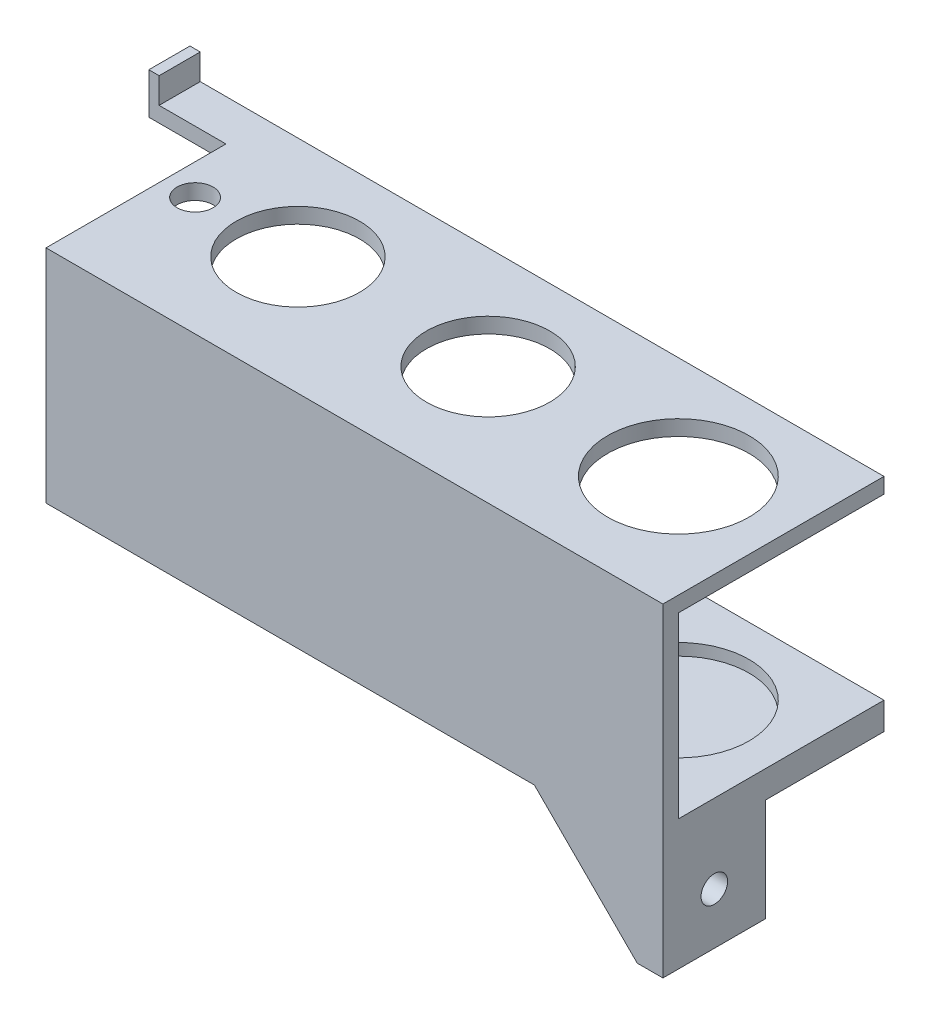
ISO-10303-21;
HEADER;
FILE_DESCRIPTION(('STEP AP214'),'2;1');
FILE_NAME('part.step','',(''),(''),'','','');
FILE_SCHEMA(('AUTOMOTIVE_DESIGN { 1 0 10303 214 1 1 1 1 }'));
ENDSEC;
DATA;
#1=APPLICATION_CONTEXT('core data for automotive mechanical design processes');
#2=APPLICATION_PROTOCOL_DEFINITION('international standard','automotive_design',2000,#1);
#3=PRODUCT_CONTEXT('',#1,'mechanical');
#4=PRODUCT('Part','Part','',(#3));
#5=PRODUCT_RELATED_PRODUCT_CATEGORY('part','',(#4));
#6=PRODUCT_DEFINITION_FORMATION('','',#4);
#7=PRODUCT_DEFINITION_CONTEXT('part definition',#1,'design');
#8=PRODUCT_DEFINITION('design','',#6,#7);
#9=PRODUCT_DEFINITION_SHAPE('','',#8);
#10=(LENGTH_UNIT() NAMED_UNIT(*) SI_UNIT(.MILLI.,.METRE.));
#11=(NAMED_UNIT(*) PLANE_ANGLE_UNIT() SI_UNIT($,.RADIAN.));
#12=(NAMED_UNIT(*) SI_UNIT($,.STERADIAN.) SOLID_ANGLE_UNIT());
#13=UNCERTAINTY_MEASURE_WITH_UNIT(LENGTH_MEASURE(1.E-05),#10,'distance_accuracy_value','');
#14=(GEOMETRIC_REPRESENTATION_CONTEXT(3) GLOBAL_UNCERTAINTY_ASSIGNED_CONTEXT((#13)) GLOBAL_UNIT_ASSIGNED_CONTEXT((#10,
#11,#12)) REPRESENTATION_CONTEXT('',''));
#15=CARTESIAN_POINT('',(0.,0.,0.));
#16=DIRECTION('',(0.,0.,1.));
#17=DIRECTION('',(1.,0.,0.));
#18=AXIS2_PLACEMENT_3D('',#15,#16,#17);
#19=CARTESIAN_POINT('',(0.,10.,0.));
#20=DIRECTION('',(0.,-1.,0.));
#21=DIRECTION('',(0.,0.,-1.));
#22=AXIS2_PLACEMENT_3D('',#19,#20,#21);
#23=PLANE('',#22);
#24=CARTESIAN_POINT('',(100.,10.,-23.));
#25=DIRECTION('',(0.,1.,0.));
#26=DIRECTION('',(0.,0.,1.));
#27=AXIS2_PLACEMENT_3D('',#24,#25,#26);
#28=CIRCLE('',#27,13.75);
#29=CARTESIAN_POINT('',(100.,10.,-9.25));
#30=VERTEX_POINT('',#29);
#31=EDGE_CURVE('E271',#30,#30,#28,.T.);
#32=ORIENTED_EDGE('',*,*,#31,.F.);
#33=EDGE_LOOP('',(#32));
#34=FACE_BOUND('',#33,.T.);
#35=CARTESIAN_POINT('',(63.,10.,-23.));
#36=DIRECTION('',(0.,1.,0.));
#37=DIRECTION('',(0.,0.,1.));
#38=AXIS2_PLACEMENT_3D('',#35,#36,#37);
#39=CIRCLE('',#38,12.);
#40=CARTESIAN_POINT('',(63.,10.,-11.));
#41=VERTEX_POINT('',#40);
#42=EDGE_CURVE('E279',#41,#41,#39,.T.);
#43=ORIENTED_EDGE('',*,*,#42,.F.);
#44=EDGE_LOOP('',(#43));
#45=FACE_BOUND('',#44,.T.);
#46=CARTESIAN_POINT('',(26.,10.,-23.));
#47=DIRECTION('',(0.,1.,0.));
#48=DIRECTION('',(0.,0.,1.));
#49=AXIS2_PLACEMENT_3D('',#46,#47,#48);
#50=CIRCLE('',#49,12.);
#51=CARTESIAN_POINT('',(26.,10.,-11.));
#52=VERTEX_POINT('',#51);
#53=EDGE_CURVE('E287',#52,#52,#50,.T.);
#54=ORIENTED_EDGE('',*,*,#53,.F.);
#55=EDGE_LOOP('',(#54));
#56=FACE_BOUND('',#55,.T.);
#57=CARTESIAN_POINT('',(6.,10.,-23.));
#58=DIRECTION('',(0.,1.,0.));
#59=DIRECTION('',(0.,0.,1.));
#60=AXIS2_PLACEMENT_3D('',#57,#58,#59);
#61=CIRCLE('',#60,3.5);
#62=CARTESIAN_POINT('',(6.,10.,-19.5));
#63=VERTEX_POINT('',#62);
#64=EDGE_CURVE('E295',#63,#63,#61,.T.);
#65=ORIENTED_EDGE('',*,*,#64,.F.);
#66=EDGE_LOOP('',(#65));
#67=FACE_BOUND('',#66,.T.);
#68=DIRECTION('',(0.,0.,-1.));
#69=VECTOR('',#68,1.);
#70=CARTESIAN_POINT('',(-13.,10.,-43.));
#71=LINE('',#70,#69);
#72=CARTESIAN_POINT('',(-13.,10.,-35.));
#73=VERTEX_POINT('',#72);
#74=CARTESIAN_POINT('',(-13.,10.,-43.));
#75=VERTEX_POINT('',#74);
#76=EDGE_CURVE('E57',#73,#75,#71,.T.);
#77=ORIENTED_EDGE('',*,*,#76,.F.);
#78=DIRECTION('',(1.,0.,0.));
#79=VECTOR('',#78,1.);
#80=CARTESIAN_POINT('',(0.,10.,-35.));
#81=LINE('',#80,#79);
#82=CARTESIAN_POINT('',(0.,10.,-35.));
#83=VERTEX_POINT('',#82);
#84=EDGE_CURVE('E201',#73,#83,#81,.T.);
#85=ORIENTED_EDGE('',*,*,#84,.T.);
#86=DIRECTION('',(0.,0.,1.));
#87=VECTOR('',#86,1.);
#88=CARTESIAN_POINT('',(0.,10.,0.));
#89=LINE('',#88,#87);
#90=CARTESIAN_POINT('',(0.,10.,0.));
#91=VERTEX_POINT('',#90);
#92=EDGE_CURVE('E303',#83,#91,#89,.T.);
#93=ORIENTED_EDGE('',*,*,#92,.T.);
#94=DIRECTION('',(1.,0.,0.));
#95=VECTOR('',#94,1.);
#96=CARTESIAN_POINT('',(0.,10.,0.));
#97=LINE('',#96,#95);
#98=CARTESIAN_POINT('',(120.,10.,0.));
#99=VERTEX_POINT('',#98);
#100=EDGE_CURVE('E306',#91,#99,#97,.T.);
#101=ORIENTED_EDGE('',*,*,#100,.T.);
#102=DIRECTION('',(0.,0.,-1.));
#103=VECTOR('',#102,1.);
#104=CARTESIAN_POINT('',(120.,10.,0.));
#105=LINE('',#104,#103);
#106=CARTESIAN_POINT('',(120.,10.,-43.));
#107=VERTEX_POINT('',#106);
#108=EDGE_CURVE('E311',#99,#107,#105,.T.);
#109=ORIENTED_EDGE('',*,*,#108,.T.);
#110=DIRECTION('',(-1.,0.,0.));
#111=VECTOR('',#110,1.);
#112=CARTESIAN_POINT('',(0.,10.,-43.));
#113=LINE('',#112,#111);
#114=EDGE_CURVE('E314',#107,#75,#113,.T.);
#115=ORIENTED_EDGE('',*,*,#114,.T.);
#116=EDGE_LOOP('',(#77,#85,#93,#101,#109,#115));
#117=FACE_BOUND('',#116,.T.);
#118=ADVANCED_FACE('F41',(#34,#45,#56,#67,#117),#23,.F.);
#119=CARTESIAN_POINT('',(0.,0.,0.));
#120=DIRECTION('',(1.,0.,0.));
#121=DIRECTION('',(0.,0.,-1.));
#122=AXIS2_PLACEMENT_3D('',#119,#120,#121);
#123=PLANE('',#122);
#124=DIRECTION('',(0.,1.,0.));
#125=VECTOR('',#124,1.);
#126=CARTESIAN_POINT('',(0.,-10.,-35.));
#127=LINE('',#126,#125);
#128=CARTESIAN_POINT('',(0.,7.,-35.));
#129=VERTEX_POINT('',#128);
#130=EDGE_CURVE('E65',#129,#83,#127,.T.);
#131=ORIENTED_EDGE('',*,*,#130,.F.);
#132=DIRECTION('',(0.,0.,1.));
#133=VECTOR('',#132,1.);
#134=CARTESIAN_POINT('',(0.,7.,0.));
#135=LINE('',#134,#133);
#136=CARTESIAN_POINT('',(0.,7.,-3.));
#137=VERTEX_POINT('',#136);
#138=EDGE_CURVE('E299',#129,#137,#135,.T.);
#139=ORIENTED_EDGE('',*,*,#138,.T.);
#140=DIRECTION('',(0.,-1.,0.));
#141=VECTOR('',#140,1.);
#142=CARTESIAN_POINT('',(0.,0.,-3.));
#143=LINE('',#142,#141);
#144=CARTESIAN_POINT('',(0.,-27.7,-3.));
#145=VERTEX_POINT('',#144);
#146=EDGE_CURVE('E406',#137,#145,#143,.T.);
#147=ORIENTED_EDGE('',*,*,#146,.T.);
#148=DIRECTION('',(0.,0.,1.));
#149=VECTOR('',#148,1.);
#150=CARTESIAN_POINT('',(0.,-27.7,-43.));
#151=LINE('',#150,#149);
#152=CARTESIAN_POINT('',(0.,-27.7,-43.));
#153=VERTEX_POINT('',#152);
#154=EDGE_CURVE('E384',#153,#145,#151,.T.);
#155=ORIENTED_EDGE('',*,*,#154,.F.);
#156=DIRECTION('',(0.,1.,0.));
#157=VECTOR('',#156,1.);
#158=CARTESIAN_POINT('',(0.,-33.,-43.));
#159=LINE('',#158,#157);
#160=CARTESIAN_POINT('',(0.,-33.,-43.));
#161=VERTEX_POINT('',#160);
#162=EDGE_CURVE('E398',#161,#153,#159,.T.);
#163=ORIENTED_EDGE('',*,*,#162,.F.);
#164=DIRECTION('',(0.,0.,-1.));
#165=VECTOR('',#164,1.);
#166=CARTESIAN_POINT('',(0.,-33.,0.));
#167=LINE('',#166,#165);
#168=CARTESIAN_POINT('',(0.,-33.,0.));
#169=VERTEX_POINT('',#168);
#170=EDGE_CURVE('E416',#169,#161,#167,.T.);
#171=ORIENTED_EDGE('',*,*,#170,.F.);
#172=DIRECTION('',(0.,-1.,0.));
#173=VECTOR('',#172,1.);
#174=CARTESIAN_POINT('',(0.,0.,0.));
#175=LINE('',#174,#173);
#176=EDGE_CURVE('E401',#91,#169,#175,.T.);
#177=ORIENTED_EDGE('',*,*,#176,.F.);
#178=ORIENTED_EDGE('',*,*,#92,.F.);
#179=EDGE_LOOP('',(#131,#139,#147,#155,#163,#171,#177,#178));
#180=FACE_BOUND('',#179,.T.);
#181=ADVANCED_FACE('F443',(#180),#123,.F.);
#182=CARTESIAN_POINT('',(115.,0.,0.));
#183=DIRECTION('',(1.,0.,0.));
#184=DIRECTION('',(0.,0.,-1.));
#185=AXIS2_PLACEMENT_3D('',#182,#183,#184);
#186=PLANE('',#185);
#187=CARTESIAN_POINT('',(115.,-43.,-10.));
#188=DIRECTION('',(1.,0.,0.));
#189=DIRECTION('',(0.,0.,-1.));
#190=AXIS2_PLACEMENT_3D('',#187,#188,#189);
#191=CIRCLE('',#190,2.58371812719711);
#192=CARTESIAN_POINT('',(115.,-43.,-12.5837181271971));
#193=VERTEX_POINT('',#192);
#194=EDGE_CURVE('E233',#193,#193,#191,.T.);
#195=ORIENTED_EDGE('',*,*,#194,.T.);
#196=EDGE_LOOP('',(#195));
#197=FACE_BOUND('',#196,.T.);
#198=DIRECTION('',(0.,1.,0.));
#199=VECTOR('',#198,1.);
#200=CARTESIAN_POINT('',(115.,-53.,-2.));
#201=LINE('',#200,#199);
#202=CARTESIAN_POINT('',(115.,-53.,-2.));
#203=VERTEX_POINT('',#202);
#204=CARTESIAN_POINT('',(115.,-33.,-2.));
#205=VERTEX_POINT('',#204);
#206=EDGE_CURVE('E218',#203,#205,#201,.T.);
#207=ORIENTED_EDGE('',*,*,#206,.T.);
#208=DIRECTION('',(0.,0.,1.));
#209=VECTOR('',#208,1.);
#210=CARTESIAN_POINT('',(115.,-33.,0.));
#211=LINE('',#210,#209);
#212=CARTESIAN_POINT('',(115.,-33.,-20.));
#213=VERTEX_POINT('',#212);
#214=EDGE_CURVE('E249',#213,#205,#211,.T.);
#215=ORIENTED_EDGE('',*,*,#214,.F.);
#216=DIRECTION('',(0.,1.,0.));
#217=VECTOR('',#216,1.);
#218=CARTESIAN_POINT('',(115.,-33.,-20.));
#219=LINE('',#218,#217);
#220=CARTESIAN_POINT('',(115.,-53.,-20.));
#221=VERTEX_POINT('',#220);
#222=EDGE_CURVE('E245',#221,#213,#219,.T.);
#223=ORIENTED_EDGE('',*,*,#222,.F.);
#224=DIRECTION('',(0.,0.,-1.));
#225=VECTOR('',#224,1.);
#226=CARTESIAN_POINT('',(115.,-53.,0.));
#227=LINE('',#226,#225);
#228=EDGE_CURVE('E246',#203,#221,#227,.T.);
#229=ORIENTED_EDGE('',*,*,#228,.F.);
#230=EDGE_LOOP('',(#207,#215,#223,#229));
#231=FACE_BOUND('',#230,.T.);
#232=ADVANCED_FACE('F480',(#197,#231),#186,.F.);
#233=CARTESIAN_POINT('',(120.,-33.,0.));
#234=DIRECTION('',(0.,1.,0.));
#235=DIRECTION('',(0.,0.,1.));
#236=AXIS2_PLACEMENT_3D('',#233,#234,#235);
#237=PLANE('',#236);
#238=CARTESIAN_POINT('',(6.,-33.,-23.));
#239=DIRECTION('',(0.,1.,0.));
#240=DIRECTION('',(0.,0.,1.));
#241=AXIS2_PLACEMENT_3D('',#238,#239,#240);
#242=CIRCLE('',#241,2.26);
#243=CARTESIAN_POINT('',(6.,-33.,-20.74));
#244=VERTEX_POINT('',#243);
#245=EDGE_CURVE('E328',#244,#244,#242,.T.);
#246=ORIENTED_EDGE('',*,*,#245,.T.);
#247=EDGE_LOOP('',(#246));
#248=FACE_BOUND('',#247,.T.);
#249=CARTESIAN_POINT('',(26.,-33.,-23.));
#250=DIRECTION('',(0.,1.,0.));
#251=DIRECTION('',(0.,0.,1.));
#252=AXIS2_PLACEMENT_3D('',#249,#250,#251);
#253=CIRCLE('',#252,2.25);
#254=CARTESIAN_POINT('',(26.,-33.,-20.75));
#255=VERTEX_POINT('',#254);
#256=EDGE_CURVE('E338',#255,#255,#253,.T.);
#257=ORIENTED_EDGE('',*,*,#256,.T.);
#258=EDGE_LOOP('',(#257));
#259=FACE_BOUND('',#258,.T.);
#260=CARTESIAN_POINT('',(63.,-33.,-23.));
#261=DIRECTION('',(0.,1.,0.));
#262=DIRECTION('',(0.,0.,1.));
#263=AXIS2_PLACEMENT_3D('',#260,#261,#262);
#264=CIRCLE('',#263,7.);
#265=CARTESIAN_POINT('',(63.,-33.,-16.));
#266=VERTEX_POINT('',#265);
#267=EDGE_CURVE('E329',#266,#266,#264,.T.);
#268=ORIENTED_EDGE('',*,*,#267,.T.);
#269=EDGE_LOOP('',(#268));
#270=FACE_BOUND('',#269,.T.);
#271=DIRECTION('',(-1.,0.,0.));
#272=VECTOR('',#271,1.);
#273=CARTESIAN_POINT('',(115.,-33.,-2.));
#274=LINE('',#273,#272);
#275=CARTESIAN_POINT('',(95.,-33.,-2.));
#276=VERTEX_POINT('',#275);
#277=EDGE_CURVE('E222',#205,#276,#274,.T.);
#278=ORIENTED_EDGE('',*,*,#277,.T.);
#279=DIRECTION('',(0.,0.,1.));
#280=VECTOR('',#279,1.);
#281=CARTESIAN_POINT('',(95.,-33.,-2.));
#282=LINE('',#281,#280);
#283=CARTESIAN_POINT('',(95.,-33.,0.));
#284=VERTEX_POINT('',#283);
#285=EDGE_CURVE('E226',#276,#284,#282,.T.);
#286=ORIENTED_EDGE('',*,*,#285,.T.);
#287=DIRECTION('',(-1.,0.,0.));
#288=VECTOR('',#287,1.);
#289=CARTESIAN_POINT('',(120.,-33.,0.));
#290=LINE('',#289,#288);
#291=EDGE_CURVE('E11',#284,#169,#290,.T.);
#292=ORIENTED_EDGE('',*,*,#291,.T.);
#293=ORIENTED_EDGE('',*,*,#170,.T.);
#294=DIRECTION('',(-1.,0.,0.));
#295=VECTOR('',#294,1.);
#296=CARTESIAN_POINT('',(120.,-33.,-43.));
#297=LINE('',#296,#295);
#298=CARTESIAN_POINT('',(120.,-33.,-43.));
#299=VERTEX_POINT('',#298);
#300=EDGE_CURVE('E394',#299,#161,#297,.T.);
#301=ORIENTED_EDGE('',*,*,#300,.F.);
#302=DIRECTION('',(0.,0.,-1.));
#303=VECTOR('',#302,1.);
#304=CARTESIAN_POINT('',(120.,-33.,0.));
#305=LINE('',#304,#303);
#306=CARTESIAN_POINT('',(120.,-33.,-20.));
#307=VERTEX_POINT('',#306);
#308=EDGE_CURVE('E405',#307,#299,#305,.T.);
#309=ORIENTED_EDGE('',*,*,#308,.F.);
#310=DIRECTION('',(1.,0.,0.));
#311=VECTOR('',#310,1.);
#312=CARTESIAN_POINT('',(115.,-33.,-20.));
#313=LINE('',#312,#311);
#314=EDGE_CURVE('E261',#213,#307,#313,.T.);
#315=ORIENTED_EDGE('',*,*,#314,.F.);
#316=ORIENTED_EDGE('',*,*,#214,.T.);
#317=EDGE_LOOP('',(#278,#286,#292,#293,#301,#309,#315,#316));
#318=FACE_BOUND('',#317,.T.);
#319=ADVANCED_FACE('F452',(#248,#259,#270,#318),#237,.F.);
#320=CARTESIAN_POINT('',(120.,0.,-3.));
#321=DIRECTION('',(0.,0.,-1.));
#322=DIRECTION('',(0.,1.,0.));
#323=AXIS2_PLACEMENT_3D('',#320,#321,#322);
#324=PLANE('',#323);
#325=DIRECTION('',(0.,-1.,0.));
#326=VECTOR('',#325,1.);
#327=CARTESIAN_POINT('',(120.,0.,-3.));
#328=LINE('',#327,#326);
#329=CARTESIAN_POINT('',(120.,7.,-3.));
#330=VERTEX_POINT('',#329);
#331=CARTESIAN_POINT('',(120.,-27.7,-3.));
#332=VERTEX_POINT('',#331);
#333=EDGE_CURVE('E409',#330,#332,#328,.T.);
#334=ORIENTED_EDGE('',*,*,#333,.T.);
#335=DIRECTION('',(1.,0.,0.));
#336=VECTOR('',#335,1.);
#337=CARTESIAN_POINT('',(120.,-27.7,-3.));
#338=LINE('',#337,#336);
#339=EDGE_CURVE('E387',#145,#332,#338,.T.);
#340=ORIENTED_EDGE('',*,*,#339,.F.);
#341=ORIENTED_EDGE('',*,*,#146,.F.);
#342=DIRECTION('',(-1.,0.,0.));
#343=VECTOR('',#342,1.);
#344=CARTESIAN_POINT('',(120.,7.,-3.));
#345=LINE('',#344,#343);
#346=EDGE_CURVE('E50',#330,#137,#345,.T.);
#347=ORIENTED_EDGE('',*,*,#346,.F.);
#348=EDGE_LOOP('',(#334,#340,#341,#347));
#349=FACE_BOUND('',#348,.T.);
#350=ADVANCED_FACE('F431',(#349),#324,.T.);
#351=CARTESIAN_POINT('',(120.,0.,0.));
#352=DIRECTION('',(0.,0.,-1.));
#353=DIRECTION('',(0.,1.,0.));
#354=AXIS2_PLACEMENT_3D('',#351,#352,#353);
#355=PLANE('',#354);
#356=ORIENTED_EDGE('',*,*,#291,.F.);
#357=DIRECTION('',(0.707106781186548,-0.707106781186548,0.));
#358=VECTOR('',#357,1.);
#359=CARTESIAN_POINT('',(95.,-33.,0.));
#360=LINE('',#359,#358);
#361=CARTESIAN_POINT('',(115.,-53.,0.));
#362=VERTEX_POINT('',#361);
#363=EDGE_CURVE('E210',#284,#362,#360,.T.);
#364=ORIENTED_EDGE('',*,*,#363,.T.);
#365=DIRECTION('',(1.,0.,0.));
#366=VECTOR('',#365,1.);
#367=CARTESIAN_POINT('',(115.,-53.,0.));
#368=LINE('',#367,#366);
#369=CARTESIAN_POINT('',(120.,-53.,0.));
#370=VERTEX_POINT('',#369);
#371=EDGE_CURVE('E253',#362,#370,#368,.T.);
#372=ORIENTED_EDGE('',*,*,#371,.T.);
#373=DIRECTION('',(0.,-1.,0.));
#374=VECTOR('',#373,1.);
#375=CARTESIAN_POINT('',(120.,0.,0.));
#376=LINE('',#375,#374);
#377=EDGE_CURVE('E402',#99,#370,#376,.T.);
#378=ORIENTED_EDGE('',*,*,#377,.F.);
#379=ORIENTED_EDGE('',*,*,#100,.F.);
#380=ORIENTED_EDGE('',*,*,#176,.T.);
#381=EDGE_LOOP('',(#356,#364,#372,#378,#379,#380));
#382=FACE_BOUND('',#381,.T.);
#383=ADVANCED_FACE('F43',(#382),#355,.F.);
#384=CARTESIAN_POINT('',(120.,0.,0.));
#385=DIRECTION('',(1.,0.,0.));
#386=DIRECTION('',(0.,0.,-1.));
#387=AXIS2_PLACEMENT_3D('',#384,#385,#386);
#388=PLANE('',#387);
#389=ORIENTED_EDGE('',*,*,#333,.F.);
#390=DIRECTION('',(0.,0.,-1.));
#391=VECTOR('',#390,1.);
#392=CARTESIAN_POINT('',(120.,7.,0.));
#393=LINE('',#392,#391);
#394=CARTESIAN_POINT('',(120.,7.,-43.));
#395=VERTEX_POINT('',#394);
#396=EDGE_CURVE('E320',#330,#395,#393,.T.);
#397=ORIENTED_EDGE('',*,*,#396,.T.);
#398=DIRECTION('',(0.,-1.,0.));
#399=VECTOR('',#398,1.);
#400=CARTESIAN_POINT('',(120.,10.,-43.));
#401=LINE('',#400,#399);
#402=EDGE_CURVE('E317',#107,#395,#401,.T.);
#403=ORIENTED_EDGE('',*,*,#402,.F.);
#404=ORIENTED_EDGE('',*,*,#108,.F.);
#405=ORIENTED_EDGE('',*,*,#377,.T.);
#406=DIRECTION('',(0.,0.,-1.));
#407=VECTOR('',#406,1.);
#408=CARTESIAN_POINT('',(120.,-53.,0.));
#409=LINE('',#408,#407);
#410=CARTESIAN_POINT('',(120.,-53.,-20.));
#411=VERTEX_POINT('',#410);
#412=EDGE_CURVE('E237',#370,#411,#409,.T.);
#413=ORIENTED_EDGE('',*,*,#412,.T.);
#414=DIRECTION('',(0.,1.,0.));
#415=VECTOR('',#414,1.);
#416=CARTESIAN_POINT('',(120.,-33.,-20.));
#417=LINE('',#416,#415);
#418=EDGE_CURVE('E257',#411,#307,#417,.T.);
#419=ORIENTED_EDGE('',*,*,#418,.T.);
#420=ORIENTED_EDGE('',*,*,#308,.T.);
#421=DIRECTION('',(0.,-1.,0.));
#422=VECTOR('',#421,1.);
#423=CARTESIAN_POINT('',(120.,-33.,-43.));
#424=LINE('',#423,#422);
#425=CARTESIAN_POINT('',(120.,-27.7,-43.));
#426=VERTEX_POINT('',#425);
#427=EDGE_CURVE('E390',#426,#299,#424,.T.);
#428=ORIENTED_EDGE('',*,*,#427,.F.);
#429=DIRECTION('',(0.,0.,-1.));
#430=VECTOR('',#429,1.);
#431=CARTESIAN_POINT('',(120.,-27.7,-43.));
#432=LINE('',#431,#430);
#433=EDGE_CURVE('E373',#332,#426,#432,.T.);
#434=ORIENTED_EDGE('',*,*,#433,.F.);
#435=EDGE_LOOP('',(#389,#397,#403,#404,#405,#413,#419,#420,#428,#434));
#436=FACE_BOUND('',#435,.T.);
#437=CARTESIAN_POINT('',(120.,-43.,-10.));
#438=DIRECTION('',(1.,0.,0.));
#439=DIRECTION('',(0.,0.,-1.));
#440=AXIS2_PLACEMENT_3D('',#437,#438,#439);
#441=CIRCLE('',#440,2.58371812719711);
#442=CARTESIAN_POINT('',(120.,-43.,-12.5837181271971));
#443=VERTEX_POINT('',#442);
#444=EDGE_CURVE('E232',#443,#443,#441,.T.);
#445=ORIENTED_EDGE('',*,*,#444,.F.);
#446=EDGE_LOOP('',(#445));
#447=FACE_BOUND('',#446,.T.);
#448=ADVANCED_FACE('F435',(#436,#447),#388,.T.);
#449=CARTESIAN_POINT('',(0.,0.,-43.));
#450=DIRECTION('',(0.,0.,1.));
#451=DIRECTION('',(0.,-1.,0.));
#452=AXIS2_PLACEMENT_3D('',#449,#450,#451);
#453=PLANE('',#452);
#454=ORIENTED_EDGE('',*,*,#427,.T.);
#455=ORIENTED_EDGE('',*,*,#300,.T.);
#456=ORIENTED_EDGE('',*,*,#162,.T.);
#457=DIRECTION('',(-1.,0.,0.));
#458=VECTOR('',#457,1.);
#459=CARTESIAN_POINT('',(120.,-27.7,-43.));
#460=LINE('',#459,#458);
#461=EDGE_CURVE('E380',#426,#153,#460,.T.);
#462=ORIENTED_EDGE('',*,*,#461,.F.);
#463=EDGE_LOOP('',(#454,#455,#456,#462));
#464=FACE_BOUND('',#463,.T.);
#465=ADVANCED_FACE('F448',(#464),#453,.F.);
#466=CARTESIAN_POINT('',(0.,-27.7,0.));
#467=DIRECTION('',(0.,-1.,0.));
#468=DIRECTION('',(0.,0.,-1.));
#469=AXIS2_PLACEMENT_3D('',#466,#467,#468);
#470=PLANE('',#469);
#471=ORIENTED_EDGE('',*,*,#433,.T.);
#472=ORIENTED_EDGE('',*,*,#461,.T.);
#473=ORIENTED_EDGE('',*,*,#154,.T.);
#474=ORIENTED_EDGE('',*,*,#339,.T.);
#475=EDGE_LOOP('',(#471,#472,#473,#474));
#476=FACE_BOUND('',#475,.T.);
#477=CARTESIAN_POINT('',(100.,-27.7,-23.));
#478=DIRECTION('',(0.,1.,0.));
#479=DIRECTION('',(0.,0.,1.));
#480=AXIS2_PLACEMENT_3D('',#477,#478,#479);
#481=CIRCLE('',#480,13.75);
#482=CARTESIAN_POINT('',(100.,-27.7,-9.25));
#483=VERTEX_POINT('',#482);
#484=EDGE_CURVE('E369',#483,#483,#481,.T.);
#485=ORIENTED_EDGE('',*,*,#484,.F.);
#486=EDGE_LOOP('',(#485));
#487=FACE_BOUND('',#486,.T.);
#488=CARTESIAN_POINT('',(63.,-27.7,-23.));
#489=DIRECTION('',(0.,1.,0.));
#490=DIRECTION('',(0.,0.,1.));
#491=AXIS2_PLACEMENT_3D('',#488,#489,#490);
#492=CIRCLE('',#491,7.59999999999998);
#493=CARTESIAN_POINT('',(63.,-27.7,-15.4));
#494=VERTEX_POINT('',#493);
#495=EDGE_CURVE('E361',#494,#494,#492,.T.);
#496=ORIENTED_EDGE('',*,*,#495,.F.);
#497=EDGE_LOOP('',(#496));
#498=FACE_BOUND('',#497,.T.);
#499=CARTESIAN_POINT('',(26.,-27.7,-23.));
#500=DIRECTION('',(0.,1.,0.));
#501=DIRECTION('',(0.,0.,1.));
#502=AXIS2_PLACEMENT_3D('',#499,#500,#501);
#503=CIRCLE('',#502,7.6);
#504=CARTESIAN_POINT('',(26.,-27.7,-15.4));
#505=VERTEX_POINT('',#504);
#506=EDGE_CURVE('E353',#505,#505,#503,.T.);
#507=ORIENTED_EDGE('',*,*,#506,.F.);
#508=EDGE_LOOP('',(#507));
#509=FACE_BOUND('',#508,.T.);
#510=CARTESIAN_POINT('',(6.,-27.7,-23.));
#511=DIRECTION('',(0.,1.,0.));
#512=DIRECTION('',(0.,0.,1.));
#513=AXIS2_PLACEMENT_3D('',#510,#511,#512);
#514=CIRCLE('',#513,2.26);
#515=CARTESIAN_POINT('',(6.,-27.7,-20.74));
#516=VERTEX_POINT('',#515);
#517=EDGE_CURVE('E333',#516,#516,#514,.T.);
#518=ORIENTED_EDGE('',*,*,#517,.F.);
#519=EDGE_LOOP('',(#518));
#520=FACE_BOUND('',#519,.T.);
#521=ADVANCED_FACE('F440',(#476,#487,#498,#509,#520),#470,.F.);
#522=CARTESIAN_POINT('',(100.,-27.7,-23.));
#523=DIRECTION('',(0.,-1.,0.));
#524=DIRECTION('',(0.,0.,-1.));
#525=AXIS2_PLACEMENT_3D('',#522,#523,#524);
#526=CYLINDRICAL_SURFACE('',#525,13.75);
#527=ORIENTED_EDGE('',*,*,#484,.T.);
#528=EDGE_LOOP('',(#527));
#529=FACE_BOUND('',#528,.T.);
#530=CARTESIAN_POINT('',(100.,-30.,-23.));
#531=DIRECTION('',(0.,1.,0.));
#532=DIRECTION('',(0.,0.,1.));
#533=AXIS2_PLACEMENT_3D('',#530,#531,#532);
#534=CIRCLE('',#533,13.75);
#535=CARTESIAN_POINT('',(100.,-30.,-9.25));
#536=VERTEX_POINT('',#535);
#537=EDGE_CURVE('E365',#536,#536,#534,.T.);
#538=ORIENTED_EDGE('',*,*,#537,.F.);
#539=EDGE_LOOP('',(#538));
#540=FACE_BOUND('',#539,.T.);
#541=ADVANCED_FACE('F513',(#529,#540),#526,.F.);
#542=CARTESIAN_POINT('',(63.,-27.7,-23.));
#543=DIRECTION('',(0.,-1.,0.));
#544=DIRECTION('',(0.,0.,-1.));
#545=AXIS2_PLACEMENT_3D('',#542,#543,#544);
#546=CYLINDRICAL_SURFACE('',#545,7.59999999999998);
#547=ORIENTED_EDGE('',*,*,#495,.T.);
#548=EDGE_LOOP('',(#547));
#549=FACE_BOUND('',#548,.T.);
#550=CARTESIAN_POINT('',(63.,-30.,-23.));
#551=DIRECTION('',(0.,1.,0.));
#552=DIRECTION('',(0.,0.,1.));
#553=AXIS2_PLACEMENT_3D('',#550,#551,#552);
#554=CIRCLE('',#553,7.59999999999998);
#555=CARTESIAN_POINT('',(63.,-30.,-15.4));
#556=VERTEX_POINT('',#555);
#557=EDGE_CURVE('E357',#556,#556,#554,.T.);
#558=ORIENTED_EDGE('',*,*,#557,.F.);
#559=EDGE_LOOP('',(#558));
#560=FACE_BOUND('',#559,.T.);
#561=ADVANCED_FACE('F509',(#549,#560),#546,.F.);
#562=CARTESIAN_POINT('',(26.,-27.7,-23.));
#563=DIRECTION('',(0.,-1.,0.));
#564=DIRECTION('',(0.,0.,-1.));
#565=AXIS2_PLACEMENT_3D('',#562,#563,#564);
#566=CYLINDRICAL_SURFACE('',#565,7.6);
#567=ORIENTED_EDGE('',*,*,#506,.T.);
#568=EDGE_LOOP('',(#567));
#569=FACE_BOUND('',#568,.T.);
#570=CARTESIAN_POINT('',(26.,-30.,-23.));
#571=DIRECTION('',(0.,1.,0.));
#572=DIRECTION('',(0.,0.,1.));
#573=AXIS2_PLACEMENT_3D('',#570,#571,#572);
#574=CIRCLE('',#573,7.6);
#575=CARTESIAN_POINT('',(26.,-30.,-15.4));
#576=VERTEX_POINT('',#575);
#577=EDGE_CURVE('E352',#576,#576,#574,.T.);
#578=ORIENTED_EDGE('',*,*,#577,.F.);
#579=EDGE_LOOP('',(#578));
#580=FACE_BOUND('',#579,.T.);
#581=ADVANCED_FACE('F505',(#569,#580),#566,.F.);
#582=CARTESIAN_POINT('',(6.,-27.7,-23.));
#583=DIRECTION('',(0.,-1.,0.));
#584=DIRECTION('',(0.,0.,-1.));
#585=AXIS2_PLACEMENT_3D('',#582,#583,#584);
#586=CYLINDRICAL_SURFACE('',#585,2.26);
#587=ORIENTED_EDGE('',*,*,#517,.T.);
#588=EDGE_LOOP('',(#587));
#589=FACE_BOUND('',#588,.T.);
#590=ORIENTED_EDGE('',*,*,#245,.F.);
#591=EDGE_LOOP('',(#590));
#592=FACE_BOUND('',#591,.T.);
#593=ADVANCED_FACE('F501',(#589,#592),#586,.F.);
#594=CARTESIAN_POINT('',(120.,-30.,-43.));
#595=DIRECTION('',(0.,-1.,0.));
#596=DIRECTION('',(0.,0.,-1.));
#597=AXIS2_PLACEMENT_3D('',#594,#595,#596);
#598=PLANE('',#597);
#599=CARTESIAN_POINT('',(26.,-30.,-23.));
#600=DIRECTION('',(0.,1.,0.));
#601=DIRECTION('',(0.,0.,1.));
#602=AXIS2_PLACEMENT_3D('',#599,#600,#601);
#603=CIRCLE('',#602,2.25);
#604=CARTESIAN_POINT('',(26.,-30.,-20.75));
#605=VERTEX_POINT('',#604);
#606=EDGE_CURVE('E342',#605,#605,#603,.T.);
#607=ORIENTED_EDGE('',*,*,#606,.F.);
#608=EDGE_LOOP('',(#607));
#609=FACE_BOUND('',#608,.T.);
#610=ORIENTED_EDGE('',*,*,#577,.T.);
#611=EDGE_LOOP('',(#610));
#612=FACE_BOUND('',#611,.T.);
#613=ADVANCED_FACE('F504',(#609,#612),#598,.F.);
#614=CARTESIAN_POINT('',(63.,-30.,-23.));
#615=DIRECTION('',(0.,1.,0.));
#616=DIRECTION('',(0.,0.,1.));
#617=AXIS2_PLACEMENT_3D('',#614,#615,#616);
#618=CIRCLE('',#617,7.);
#619=CARTESIAN_POINT('',(63.,-30.,-16.));
#620=VERTEX_POINT('',#619);
#621=EDGE_CURVE('E334',#620,#620,#618,.T.);
#622=ORIENTED_EDGE('',*,*,#621,.F.);
#623=EDGE_LOOP('',(#622));
#624=FACE_BOUND('',#623,.T.);
#625=ORIENTED_EDGE('',*,*,#557,.T.);
#626=EDGE_LOOP('',(#625));
#627=FACE_BOUND('',#626,.T.);
#628=ADVANCED_FACE('F524',(#624,#627),#598,.F.);
#629=ORIENTED_EDGE('',*,*,#537,.T.);
#630=EDGE_LOOP('',(#629));
#631=FACE_BOUND('',#630,.T.);
#632=ADVANCED_FACE('F499',(#631),#598,.F.);
#633=CARTESIAN_POINT('',(26.,-33.,-23.));
#634=DIRECTION('',(0.,1.,0.));
#635=DIRECTION('',(0.,0.,1.));
#636=AXIS2_PLACEMENT_3D('',#633,#634,#635);
#637=CYLINDRICAL_SURFACE('',#636,2.25);
#638=ORIENTED_EDGE('',*,*,#256,.F.);
#639=EDGE_LOOP('',(#638));
#640=FACE_BOUND('',#639,.T.);
#641=ORIENTED_EDGE('',*,*,#606,.T.);
#642=EDGE_LOOP('',(#641));
#643=FACE_BOUND('',#642,.T.);
#644=ADVANCED_FACE('F495',(#640,#643),#637,.F.);
#645=CARTESIAN_POINT('',(63.,-33.,-23.));
#646=DIRECTION('',(0.,1.,0.));
#647=DIRECTION('',(0.,0.,1.));
#648=AXIS2_PLACEMENT_3D('',#645,#646,#647);
#649=CYLINDRICAL_SURFACE('',#648,7.);
#650=ORIENTED_EDGE('',*,*,#267,.F.);
#651=EDGE_LOOP('',(#650));
#652=FACE_BOUND('',#651,.T.);
#653=ORIENTED_EDGE('',*,*,#621,.T.);
#654=EDGE_LOOP('',(#653));
#655=FACE_BOUND('',#654,.T.);
#656=ADVANCED_FACE('F489',(#652,#655),#649,.F.);
#657=CARTESIAN_POINT('',(0.,7.,0.));
#658=DIRECTION('',(0.,-1.,0.));
#659=DIRECTION('',(0.,0.,-1.));
#660=AXIS2_PLACEMENT_3D('',#657,#658,#659);
#661=PLANE('',#660);
#662=CARTESIAN_POINT('',(63.,7.,-23.));
#663=DIRECTION('',(0.,1.,0.));
#664=DIRECTION('',(0.,0.,1.));
#665=AXIS2_PLACEMENT_3D('',#662,#663,#664);
#666=CIRCLE('',#665,12.);
#667=CARTESIAN_POINT('',(63.,7.,-11.));
#668=VERTEX_POINT('',#667);
#669=EDGE_CURVE('E275',#668,#668,#666,.T.);
#670=ORIENTED_EDGE('',*,*,#669,.T.);
#671=EDGE_LOOP('',(#670));
#672=FACE_BOUND('',#671,.T.);
#673=CARTESIAN_POINT('',(6.,7.,-23.));
#674=DIRECTION('',(0.,1.,0.));
#675=DIRECTION('',(0.,0.,1.));
#676=AXIS2_PLACEMENT_3D('',#673,#674,#675);
#677=CIRCLE('',#676,3.5);
#678=CARTESIAN_POINT('',(6.,7.,-19.5));
#679=VERTEX_POINT('',#678);
#680=EDGE_CURVE('E291',#679,#679,#677,.T.);
#681=ORIENTED_EDGE('',*,*,#680,.T.);
#682=EDGE_LOOP('',(#681));
#683=FACE_BOUND('',#682,.T.);
#684=ORIENTED_EDGE('',*,*,#396,.F.);
#685=ORIENTED_EDGE('',*,*,#346,.T.);
#686=ORIENTED_EDGE('',*,*,#138,.F.);
#687=DIRECTION('',(1.,0.,0.));
#688=VECTOR('',#687,1.);
#689=CARTESIAN_POINT('',(0.,7.,-35.));
#690=LINE('',#689,#688);
#691=CARTESIAN_POINT('',(-15.,7.,-35.));
#692=VERTEX_POINT('',#691);
#693=EDGE_CURVE('E170',#692,#129,#690,.T.);
#694=ORIENTED_EDGE('',*,*,#693,.F.);
#695=DIRECTION('',(0.,0.,1.));
#696=VECTOR('',#695,1.);
#697=CARTESIAN_POINT('',(-15.,7.,-43.));
#698=LINE('',#697,#696);
#699=CARTESIAN_POINT('',(-15.,7.,-43.));
#700=VERTEX_POINT('',#699);
#701=EDGE_CURVE('E166',#700,#692,#698,.T.);
#702=ORIENTED_EDGE('',*,*,#701,.F.);
#703=DIRECTION('',(-1.,0.,0.));
#704=VECTOR('',#703,1.);
#705=CARTESIAN_POINT('',(0.,7.,-43.));
#706=LINE('',#705,#704);
#707=EDGE_CURVE('E307',#395,#700,#706,.T.);
#708=ORIENTED_EDGE('',*,*,#707,.F.);
#709=EDGE_LOOP('',(#684,#685,#686,#694,#702,#708));
#710=FACE_BOUND('',#709,.T.);
#711=CARTESIAN_POINT('',(26.,7.,-23.));
#712=DIRECTION('',(0.,1.,0.));
#713=DIRECTION('',(0.,0.,1.));
#714=AXIS2_PLACEMENT_3D('',#711,#712,#713);
#715=CIRCLE('',#714,12.);
#716=CARTESIAN_POINT('',(26.,7.,-11.));
#717=VERTEX_POINT('',#716);
#718=EDGE_CURVE('E283',#717,#717,#715,.T.);
#719=ORIENTED_EDGE('',*,*,#718,.T.);
#720=EDGE_LOOP('',(#719));
#721=FACE_BOUND('',#720,.T.);
#722=CARTESIAN_POINT('',(100.,7.,-23.));
#723=DIRECTION('',(0.,1.,0.));
#724=DIRECTION('',(0.,0.,1.));
#725=AXIS2_PLACEMENT_3D('',#722,#723,#724);
#726=CIRCLE('',#725,13.75);
#727=CARTESIAN_POINT('',(100.,7.,-9.25));
#728=VERTEX_POINT('',#727);
#729=EDGE_CURVE('E264',#728,#728,#726,.T.);
#730=ORIENTED_EDGE('',*,*,#729,.T.);
#731=EDGE_LOOP('',(#730));
#732=FACE_BOUND('',#731,.T.);
#733=ADVANCED_FACE('F425',(#672,#683,#710,#721,#732),#661,.T.);
#734=CARTESIAN_POINT('',(0.,10.,-43.));
#735=DIRECTION('',(0.,0.,1.));
#736=DIRECTION('',(1.,0.,0.));
#737=AXIS2_PLACEMENT_3D('',#734,#735,#736);
#738=PLANE('',#737);
#739=ORIENTED_EDGE('',*,*,#707,.T.);
#740=DIRECTION('',(0.,1.,0.));
#741=VECTOR('',#740,1.);
#742=CARTESIAN_POINT('',(-15.,-10.,-43.));
#743=LINE('',#742,#741);
#744=CARTESIAN_POINT('',(-15.,15.,-43.));
#745=VERTEX_POINT('',#744);
#746=EDGE_CURVE('E204',#700,#745,#743,.T.);
#747=ORIENTED_EDGE('',*,*,#746,.T.);
#748=DIRECTION('',(-1.,0.,0.));
#749=VECTOR('',#748,1.);
#750=CARTESIAN_POINT('',(-15.,15.,-43.));
#751=LINE('',#750,#749);
#752=CARTESIAN_POINT('',(-13.,15.,-43.));
#753=VERTEX_POINT('',#752);
#754=EDGE_CURVE('E185',#753,#745,#751,.T.);
#755=ORIENTED_EDGE('',*,*,#754,.F.);
#756=DIRECTION('',(0.,-1.,0.));
#757=VECTOR('',#756,1.);
#758=CARTESIAN_POINT('',(-13.,15.,-43.));
#759=LINE('',#758,#757);
#760=EDGE_CURVE('E194',#753,#75,#759,.T.);
#761=ORIENTED_EDGE('',*,*,#760,.T.);
#762=ORIENTED_EDGE('',*,*,#114,.F.);
#763=ORIENTED_EDGE('',*,*,#402,.T.);
#764=EDGE_LOOP('',(#739,#747,#755,#761,#762,#763));
#765=FACE_BOUND('',#764,.T.);
#766=ADVANCED_FACE('F458',(#765),#738,.F.);
#767=CARTESIAN_POINT('',(6.,10.,-23.));
#768=DIRECTION('',(0.,-1.,0.));
#769=DIRECTION('',(0.,0.,-1.));
#770=AXIS2_PLACEMENT_3D('',#767,#768,#769);
#771=CYLINDRICAL_SURFACE('',#770,3.5);
#772=ORIENTED_EDGE('',*,*,#64,.T.);
#773=EDGE_LOOP('',(#772));
#774=FACE_BOUND('',#773,.T.);
#775=ORIENTED_EDGE('',*,*,#680,.F.);
#776=EDGE_LOOP('',(#775));
#777=FACE_BOUND('',#776,.T.);
#778=ADVANCED_FACE('F486',(#774,#777),#771,.F.);
#779=CARTESIAN_POINT('',(26.,10.,-23.));
#780=DIRECTION('',(0.,-1.,0.));
#781=DIRECTION('',(0.,0.,-1.));
#782=AXIS2_PLACEMENT_3D('',#779,#780,#781);
#783=CYLINDRICAL_SURFACE('',#782,12.);
#784=ORIENTED_EDGE('',*,*,#53,.T.);
#785=EDGE_LOOP('',(#784));
#786=FACE_BOUND('',#785,.T.);
#787=ORIENTED_EDGE('',*,*,#718,.F.);
#788=EDGE_LOOP('',(#787));
#789=FACE_BOUND('',#788,.T.);
#790=ADVANCED_FACE('F615',(#786,#789),#783,.F.);
#791=CARTESIAN_POINT('',(63.,10.,-23.));
#792=DIRECTION('',(0.,-1.,0.));
#793=DIRECTION('',(0.,0.,-1.));
#794=AXIS2_PLACEMENT_3D('',#791,#792,#793);
#795=CYLINDRICAL_SURFACE('',#794,12.);
#796=ORIENTED_EDGE('',*,*,#42,.T.);
#797=EDGE_LOOP('',(#796));
#798=FACE_BOUND('',#797,.T.);
#799=ORIENTED_EDGE('',*,*,#669,.F.);
#800=EDGE_LOOP('',(#799));
#801=FACE_BOUND('',#800,.T.);
#802=ADVANCED_FACE('F625',(#798,#801),#795,.F.);
#803=CARTESIAN_POINT('',(100.,10.,-23.));
#804=DIRECTION('',(0.,-1.,0.));
#805=DIRECTION('',(0.,0.,-1.));
#806=AXIS2_PLACEMENT_3D('',#803,#804,#805);
#807=CYLINDRICAL_SURFACE('',#806,13.75);
#808=ORIENTED_EDGE('',*,*,#31,.T.);
#809=EDGE_LOOP('',(#808));
#810=FACE_BOUND('',#809,.T.);
#811=ORIENTED_EDGE('',*,*,#729,.F.);
#812=EDGE_LOOP('',(#811));
#813=FACE_BOUND('',#812,.T.);
#814=ADVANCED_FACE('F633',(#810,#813),#807,.F.);
#815=CARTESIAN_POINT('',(115.,-33.,-20.));
#816=DIRECTION('',(0.,0.,-1.));
#817=DIRECTION('',(0.,1.,0.));
#818=AXIS2_PLACEMENT_3D('',#815,#816,#817);
#819=PLANE('',#818);
#820=ORIENTED_EDGE('',*,*,#418,.F.);
#821=DIRECTION('',(1.,0.,0.));
#822=VECTOR('',#821,1.);
#823=CARTESIAN_POINT('',(115.,-53.,-20.));
#824=LINE('',#823,#822);
#825=EDGE_CURVE('E265',#221,#411,#824,.T.);
#826=ORIENTED_EDGE('',*,*,#825,.F.);
#827=ORIENTED_EDGE('',*,*,#222,.T.);
#828=ORIENTED_EDGE('',*,*,#314,.T.);
#829=EDGE_LOOP('',(#820,#826,#827,#828));
#830=FACE_BOUND('',#829,.T.);
#831=ADVANCED_FACE('F642',(#830),#819,.T.);
#832=CARTESIAN_POINT('',(115.,-53.,0.));
#833=DIRECTION('',(0.,-1.,0.));
#834=DIRECTION('',(0.,0.,-1.));
#835=AXIS2_PLACEMENT_3D('',#832,#833,#834);
#836=PLANE('',#835);
#837=ORIENTED_EDGE('',*,*,#412,.F.);
#838=ORIENTED_EDGE('',*,*,#371,.F.);
#839=EDGE_CURVE('E241',#362,#203,#227,.T.);
#840=ORIENTED_EDGE('',*,*,#839,.T.);
#841=ORIENTED_EDGE('',*,*,#228,.T.);
#842=ORIENTED_EDGE('',*,*,#825,.T.);
#843=EDGE_LOOP('',(#837,#838,#840,#841,#842));
#844=FACE_BOUND('',#843,.T.);
#845=ADVANCED_FACE('F652',(#844),#836,.T.);
#846=CARTESIAN_POINT('',(115.,-43.,-10.));
#847=DIRECTION('',(1.,0.,0.));
#848=DIRECTION('',(0.,0.,-1.));
#849=AXIS2_PLACEMENT_3D('',#846,#847,#848);
#850=CYLINDRICAL_SURFACE('',#849,2.58371812719711);
#851=ORIENTED_EDGE('',*,*,#194,.F.);
#852=EDGE_LOOP('',(#851));
#853=FACE_BOUND('',#852,.T.);
#854=ORIENTED_EDGE('',*,*,#444,.T.);
#855=EDGE_LOOP('',(#854));
#856=FACE_BOUND('',#855,.T.);
#857=ADVANCED_FACE('F660',(#853,#856),#850,.F.);
#858=CARTESIAN_POINT('',(95.,-33.,-2.));
#859=DIRECTION('',(-0.707106781186547,-0.707106781186547,0.));
#860=DIRECTION('',(0.707106781186548,-0.707106781186548,0.));
#861=AXIS2_PLACEMENT_3D('',#858,#859,#860);
#862=PLANE('',#861);
#863=ORIENTED_EDGE('',*,*,#363,.F.);
#864=ORIENTED_EDGE('',*,*,#285,.F.);
#865=DIRECTION('',(0.707106781186548,-0.707106781186548,0.));
#866=VECTOR('',#865,1.);
#867=CARTESIAN_POINT('',(95.,-33.,-2.));
#868=LINE('',#867,#866);
#869=EDGE_CURVE('E214',#276,#203,#868,.T.);
#870=ORIENTED_EDGE('',*,*,#869,.T.);
#871=ORIENTED_EDGE('',*,*,#839,.F.);
#872=EDGE_LOOP('',(#863,#864,#870,#871));
#873=FACE_BOUND('',#872,.T.);
#874=ADVANCED_FACE('F668',(#873),#862,.T.);
#875=CARTESIAN_POINT('',(0.,0.,-2.));
#876=DIRECTION('',(0.,0.,1.));
#877=DIRECTION('',(1.,0.,0.));
#878=AXIS2_PLACEMENT_3D('',#875,#876,#877);
#879=PLANE('',#878);
#880=ORIENTED_EDGE('',*,*,#869,.F.);
#881=ORIENTED_EDGE('',*,*,#277,.F.);
#882=ORIENTED_EDGE('',*,*,#206,.F.);
#883=EDGE_LOOP('',(#880,#881,#882));
#884=FACE_BOUND('',#883,.T.);
#885=ADVANCED_FACE('F676',(#884),#879,.F.);
#886=CARTESIAN_POINT('',(-15.,-10.,-43.));
#887=DIRECTION('',(-1.,0.,0.));
#888=DIRECTION('',(0.,0.,1.));
#889=AXIS2_PLACEMENT_3D('',#886,#887,#888);
#890=PLANE('',#889);
#891=ORIENTED_EDGE('',*,*,#746,.F.);
#892=ORIENTED_EDGE('',*,*,#701,.T.);
#893=DIRECTION('',(0.,1.,0.));
#894=VECTOR('',#893,1.);
#895=CARTESIAN_POINT('',(-15.,-10.,-35.));
#896=LINE('',#895,#894);
#897=CARTESIAN_POINT('',(-15.,15.,-35.));
#898=VERTEX_POINT('',#897);
#899=EDGE_CURVE('E159',#692,#898,#896,.T.);
#900=ORIENTED_EDGE('',*,*,#899,.T.);
#901=DIRECTION('',(0.,0.,1.));
#902=VECTOR('',#901,1.);
#903=CARTESIAN_POINT('',(-15.,15.,-43.));
#904=LINE('',#903,#902);
#905=EDGE_CURVE('E164',#745,#898,#904,.T.);
#906=ORIENTED_EDGE('',*,*,#905,.F.);
#907=EDGE_LOOP('',(#891,#892,#900,#906));
#908=FACE_BOUND('',#907,.T.);
#909=ADVANCED_FACE('F162',(#908),#890,.T.);
#910=CARTESIAN_POINT('',(0.,-10.,-35.));
#911=DIRECTION('',(0.,0.,1.));
#912=DIRECTION('',(1.,0.,0.));
#913=AXIS2_PLACEMENT_3D('',#910,#911,#912);
#914=PLANE('',#913);
#915=ORIENTED_EDGE('',*,*,#899,.F.);
#916=ORIENTED_EDGE('',*,*,#693,.T.);
#917=ORIENTED_EDGE('',*,*,#130,.T.);
#918=ORIENTED_EDGE('',*,*,#84,.F.);
#919=DIRECTION('',(0.,-1.,0.));
#920=VECTOR('',#919,1.);
#921=CARTESIAN_POINT('',(-13.,15.,-35.));
#922=LINE('',#921,#920);
#923=CARTESIAN_POINT('',(-13.,15.,-35.));
#924=VERTEX_POINT('',#923);
#925=EDGE_CURVE('E176',#924,#73,#922,.T.);
#926=ORIENTED_EDGE('',*,*,#925,.F.);
#927=DIRECTION('',(1.,0.,0.));
#928=VECTOR('',#927,1.);
#929=CARTESIAN_POINT('',(-15.,15.,-35.));
#930=LINE('',#929,#928);
#931=EDGE_CURVE('E173',#898,#924,#930,.T.);
#932=ORIENTED_EDGE('',*,*,#931,.F.);
#933=EDGE_LOOP('',(#915,#916,#917,#918,#926,#932));
#934=FACE_BOUND('',#933,.T.);
#935=ADVANCED_FACE('F174',(#934),#914,.T.);
#936=CARTESIAN_POINT('',(-13.,15.,-43.));
#937=DIRECTION('',(-1.,0.,0.));
#938=DIRECTION('',(0.,0.,1.));
#939=AXIS2_PLACEMENT_3D('',#936,#937,#938);
#940=PLANE('',#939);
#941=ORIENTED_EDGE('',*,*,#76,.T.);
#942=ORIENTED_EDGE('',*,*,#760,.F.);
#943=DIRECTION('',(0.,0.,-1.));
#944=VECTOR('',#943,1.);
#945=CARTESIAN_POINT('',(-13.,15.,-43.));
#946=LINE('',#945,#944);
#947=EDGE_CURVE('E180',#924,#753,#946,.T.);
#948=ORIENTED_EDGE('',*,*,#947,.F.);
#949=ORIENTED_EDGE('',*,*,#925,.T.);
#950=EDGE_LOOP('',(#941,#942,#948,#949));
#951=FACE_BOUND('',#950,.T.);
#952=ADVANCED_FACE('F463',(#951),#940,.F.);
#953=CARTESIAN_POINT('',(0.,15.,0.));
#954=DIRECTION('',(0.,1.,0.));
#955=DIRECTION('',(0.,0.,1.));
#956=AXIS2_PLACEMENT_3D('',#953,#954,#955);
#957=PLANE('',#956);
#958=ORIENTED_EDGE('',*,*,#905,.T.);
#959=ORIENTED_EDGE('',*,*,#931,.T.);
#960=ORIENTED_EDGE('',*,*,#947,.T.);
#961=ORIENTED_EDGE('',*,*,#754,.T.);
#962=EDGE_LOOP('',(#958,#959,#960,#961));
#963=FACE_BOUND('',#962,.T.);
#964=ADVANCED_FACE('F183',(#963),#957,.T.);
#965=CLOSED_SHELL('',(#118,#181,#232,#319,#350,#383,#448,#465,#521,#541,#561,#581,#593,#613,
#628,#632,#644,#656,#733,#766,#778,#790,#802,#814,#831,#845,#857,#874,#885,#909,#935,#952,#964));
#966=MANIFOLD_SOLID_BREP('B2',#965);
#967=ADVANCED_BREP_SHAPE_REPRESENTATION('',(#18,#966),#14);
#968=SHAPE_DEFINITION_REPRESENTATION(#9,#967);
ENDSEC;
END-ISO-10303-21;
